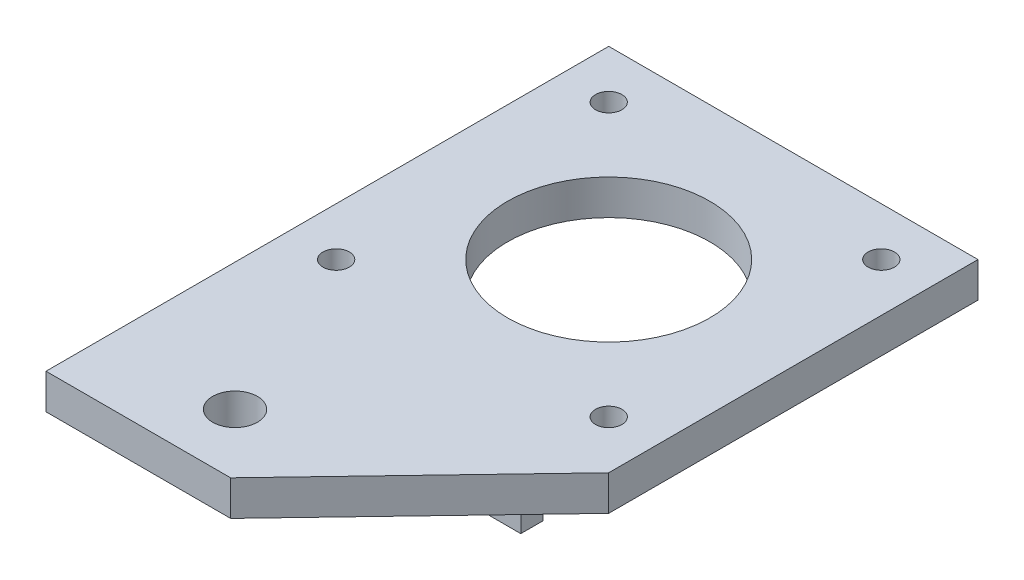
ISO-10303-21;
HEADER;
FILE_DESCRIPTION(('STEP AP214'),'2;1');
FILE_NAME('part.step','',(''),(''),'','','');
FILE_SCHEMA(('AUTOMOTIVE_DESIGN { 1 0 10303 214 1 1 1 1 }'));
ENDSEC;
DATA;
#1=APPLICATION_CONTEXT('core data for automotive mechanical design processes');
#2=APPLICATION_PROTOCOL_DEFINITION('international standard','automotive_design',2000,#1);
#3=PRODUCT_CONTEXT('',#1,'mechanical');
#4=PRODUCT('Part','Part','',(#3));
#5=PRODUCT_RELATED_PRODUCT_CATEGORY('part','',(#4));
#6=PRODUCT_DEFINITION_FORMATION('','',#4);
#7=PRODUCT_DEFINITION_CONTEXT('part definition',#1,'design');
#8=PRODUCT_DEFINITION('design','',#6,#7);
#9=PRODUCT_DEFINITION_SHAPE('','',#8);
#10=(LENGTH_UNIT() NAMED_UNIT(*) SI_UNIT(.MILLI.,.METRE.));
#11=(NAMED_UNIT(*) PLANE_ANGLE_UNIT() SI_UNIT($,.RADIAN.));
#12=(NAMED_UNIT(*) SI_UNIT($,.STERADIAN.) SOLID_ANGLE_UNIT());
#13=UNCERTAINTY_MEASURE_WITH_UNIT(LENGTH_MEASURE(1.E-05),#10,'distance_accuracy_value','');
#14=(GEOMETRIC_REPRESENTATION_CONTEXT(3) GLOBAL_UNCERTAINTY_ASSIGNED_CONTEXT((#13)) GLOBAL_UNIT_ASSIGNED_CONTEXT((#10,
#11,#12)) REPRESENTATION_CONTEXT('',''));
#15=CARTESIAN_POINT('',(0.,0.,0.));
#16=DIRECTION('',(0.,0.,1.));
#17=DIRECTION('',(1.,0.,0.));
#18=AXIS2_PLACEMENT_3D('',#15,#16,#17);
#19=CARTESIAN_POINT('',(0.,0.,0.));
#20=DIRECTION('',(0.,1.,0.));
#21=DIRECTION('',(0.,0.,1.));
#22=AXIS2_PLACEMENT_3D('',#19,#20,#21);
#23=PLANE('',#22);
#24=CARTESIAN_POINT('',(5.5,0.,-5.49999999999998));
#25=DIRECTION('',(0.,1.,0.));
#26=DIRECTION('',(0.,0.,1.));
#27=AXIS2_PLACEMENT_3D('',#24,#25,#26);
#28=CIRCLE('',#27,1.5);
#29=CARTESIAN_POINT('',(5.5,0.,-3.99999999999998));
#30=VERTEX_POINT('',#29);
#31=EDGE_CURVE('E142',#30,#30,#28,.F.);
#32=ORIENTED_EDGE('',*,*,#31,.F.);
#33=EDGE_LOOP('',(#32));
#34=FACE_BOUND('',#33,.T.);
#35=CARTESIAN_POINT('',(36.5,0.,-5.49999999999998));
#36=DIRECTION('',(0.,1.,0.));
#37=DIRECTION('',(0.,0.,1.));
#38=AXIS2_PLACEMENT_3D('',#35,#36,#37);
#39=CIRCLE('',#38,1.5);
#40=CARTESIAN_POINT('',(36.5,0.,-3.99999999999998));
#41=VERTEX_POINT('',#40);
#42=EDGE_CURVE('E190',#41,#41,#39,.T.);
#43=ORIENTED_EDGE('',*,*,#42,.T.);
#44=EDGE_LOOP('',(#43));
#45=FACE_BOUND('',#44,.T.);
#46=CARTESIAN_POINT('',(5.5,0.,-36.5));
#47=DIRECTION('',(0.,1.,0.));
#48=DIRECTION('',(0.,0.,1.));
#49=AXIS2_PLACEMENT_3D('',#46,#47,#48);
#50=CIRCLE('',#49,1.5);
#51=CARTESIAN_POINT('',(5.5,0.,-35.));
#52=VERTEX_POINT('',#51);
#53=EDGE_CURVE('E187',#52,#52,#50,.T.);
#54=ORIENTED_EDGE('',*,*,#53,.T.);
#55=EDGE_LOOP('',(#54));
#56=FACE_BOUND('',#55,.T.);
#57=CARTESIAN_POINT('',(21.,0.,-21.));
#58=DIRECTION('',(0.,1.,0.));
#59=DIRECTION('',(0.,0.,1.));
#60=AXIS2_PLACEMENT_3D('',#57,#58,#59);
#61=CIRCLE('',#60,11.5);
#62=CARTESIAN_POINT('',(21.,0.,-9.49999999999999));
#63=VERTEX_POINT('',#62);
#64=EDGE_CURVE('E184',#63,#63,#61,.T.);
#65=ORIENTED_EDGE('',*,*,#64,.T.);
#66=EDGE_LOOP('',(#65));
#67=FACE_BOUND('',#66,.T.);
#68=CARTESIAN_POINT('',(36.5,0.,-36.5));
#69=DIRECTION('',(0.,1.,0.));
#70=DIRECTION('',(0.,0.,1.));
#71=AXIS2_PLACEMENT_3D('',#68,#69,#70);
#72=CIRCLE('',#71,1.5);
#73=CARTESIAN_POINT('',(36.5,0.,-35.));
#74=VERTEX_POINT('',#73);
#75=EDGE_CURVE('E181',#74,#74,#72,.F.);
#76=ORIENTED_EDGE('',*,*,#75,.F.);
#77=EDGE_LOOP('',(#76));
#78=FACE_BOUND('',#77,.T.);
#79=CARTESIAN_POINT('',(14.5,0.,15.));
#80=DIRECTION('',(0.,1.,0.));
#81=DIRECTION('',(0.,0.,1.));
#82=AXIS2_PLACEMENT_3D('',#79,#80,#81);
#83=CIRCLE('',#82,2.55);
#84=CARTESIAN_POINT('',(14.5,0.,17.55));
#85=VERTEX_POINT('',#84);
#86=EDGE_CURVE('E129',#85,#85,#83,.T.);
#87=ORIENTED_EDGE('',*,*,#86,.T.);
#88=EDGE_LOOP('',(#87));
#89=FACE_BOUND('',#88,.T.);
#90=DIRECTION('',(-1.,0.,0.));
#91=VECTOR('',#90,1.);
#92=CARTESIAN_POINT('',(0.,0.,2.99999999999999));
#93=LINE('',#92,#91);
#94=CARTESIAN_POINT('',(35.,0.,2.99999999999999));
#95=VERTEX_POINT('',#94);
#96=CARTESIAN_POINT('',(0.,0.,2.99999999999999));
#97=VERTEX_POINT('',#96);
#98=EDGE_CURVE('E50',#95,#97,#93,.T.);
#99=ORIENTED_EDGE('',*,*,#98,.F.);
#100=DIRECTION('',(0.,0.,1.));
#101=VECTOR('',#100,1.);
#102=CARTESIAN_POINT('',(35.,0.,2.99999999999999));
#103=LINE('',#102,#101);
#104=CARTESIAN_POINT('',(35.,0.,0.499999999999995));
#105=VERTEX_POINT('',#104);
#106=EDGE_CURVE('E229',#105,#95,#103,.T.);
#107=ORIENTED_EDGE('',*,*,#106,.F.);
#108=DIRECTION('',(1.,0.,0.));
#109=VECTOR('',#108,1.);
#110=CARTESIAN_POINT('',(0.,0.,0.499999999999995));
#111=LINE('',#110,#109);
#112=CARTESIAN_POINT('',(0.,0.,0.499999999999995));
#113=VERTEX_POINT('',#112);
#114=EDGE_CURVE('E231',#113,#105,#111,.T.);
#115=ORIENTED_EDGE('',*,*,#114,.F.);
#116=DIRECTION('',(0.,0.,1.));
#117=VECTOR('',#116,1.);
#118=CARTESIAN_POINT('',(0.,0.,0.));
#119=LINE('',#118,#117);
#120=CARTESIAN_POINT('',(0.,0.,-42.));
#121=VERTEX_POINT('',#120);
#122=EDGE_CURVE('E128',#121,#113,#119,.T.);
#123=ORIENTED_EDGE('',*,*,#122,.F.);
#124=DIRECTION('',(1.,0.,0.));
#125=VECTOR('',#124,1.);
#126=CARTESIAN_POINT('',(0.,0.,-42.));
#127=LINE('',#126,#125);
#128=CARTESIAN_POINT('',(42.,0.,-42.));
#129=VERTEX_POINT('',#128);
#130=EDGE_CURVE('E177',#121,#129,#127,.T.);
#131=ORIENTED_EDGE('',*,*,#130,.T.);
#132=DIRECTION('',(0.,0.,-1.));
#133=VECTOR('',#132,1.);
#134=CARTESIAN_POINT('',(42.,0.,0.));
#135=LINE('',#134,#133);
#136=CARTESIAN_POINT('',(42.,0.,0.));
#137=VERTEX_POINT('',#136);
#138=EDGE_CURVE('E174',#137,#129,#135,.T.);
#139=ORIENTED_EDGE('',*,*,#138,.F.);
#140=DIRECTION('',(0.690475746682501,0.,-0.723355544143572));
#141=VECTOR('',#140,1.);
#142=CARTESIAN_POINT('',(21.9762162162162,0.,20.9772972972973));
#143=LINE('',#142,#141);
#144=CARTESIAN_POINT('',(21.,0.,22.));
#145=VERTEX_POINT('',#144);
#146=EDGE_CURVE('E172',#145,#137,#143,.T.);
#147=ORIENTED_EDGE('',*,*,#146,.F.);
#148=DIRECTION('',(1.,0.,0.));
#149=VECTOR('',#148,1.);
#150=CARTESIAN_POINT('',(0.,0.,22.));
#151=LINE('',#150,#149);
#152=CARTESIAN_POINT('',(0.,0.,22.));
#153=VERTEX_POINT('',#152);
#154=EDGE_CURVE('E132',#153,#145,#151,.T.);
#155=ORIENTED_EDGE('',*,*,#154,.F.);
#156=EDGE_CURVE('E55',#97,#153,#119,.T.);
#157=ORIENTED_EDGE('',*,*,#156,.F.);
#158=EDGE_LOOP('',(#99,#107,#115,#123,#131,#139,#147,#155,#157));
#159=FACE_BOUND('',#158,.T.);
#160=ADVANCED_FACE('F35',(#34,#45,#56,#67,#78,#89,#159),#23,.F.);
#161=CARTESIAN_POINT('',(0.,4.,22.));
#162=DIRECTION('',(0.,0.,-1.));
#163=DIRECTION('',(-1.,0.,0.));
#164=AXIS2_PLACEMENT_3D('',#161,#162,#163);
#165=PLANE('',#164);
#166=ORIENTED_EDGE('',*,*,#154,.T.);
#167=DIRECTION('',(0.,-1.,0.));
#168=VECTOR('',#167,1.);
#169=CARTESIAN_POINT('',(21.,4.,22.));
#170=LINE('',#169,#168);
#171=CARTESIAN_POINT('',(21.,4.,22.));
#172=VERTEX_POINT('',#171);
#173=EDGE_CURVE('E11',#172,#145,#170,.T.);
#174=ORIENTED_EDGE('',*,*,#173,.F.);
#175=DIRECTION('',(1.,0.,0.));
#176=VECTOR('',#175,1.);
#177=CARTESIAN_POINT('',(0.,4.,22.));
#178=LINE('',#177,#176);
#179=CARTESIAN_POINT('',(0.,4.,22.));
#180=VERTEX_POINT('',#179);
#181=EDGE_CURVE('E141',#180,#172,#178,.T.);
#182=ORIENTED_EDGE('',*,*,#181,.F.);
#183=DIRECTION('',(0.,-1.,0.));
#184=VECTOR('',#183,1.);
#185=CARTESIAN_POINT('',(0.,4.,22.));
#186=LINE('',#185,#184);
#187=EDGE_CURVE('E168',#180,#153,#186,.T.);
#188=ORIENTED_EDGE('',*,*,#187,.T.);
#189=EDGE_LOOP('',(#166,#174,#182,#188));
#190=FACE_BOUND('',#189,.T.);
#191=ADVANCED_FACE('F221',(#190),#165,.F.);
#192=CARTESIAN_POINT('',(21.9762162162162,4.,20.9772972972973));
#193=DIRECTION('',(-0.723355544143572,0.,-0.690475746682501));
#194=DIRECTION('',(-0.690475746682501,0.,0.723355544143572));
#195=AXIS2_PLACEMENT_3D('',#192,#193,#194);
#196=PLANE('',#195);
#197=ORIENTED_EDGE('',*,*,#146,.T.);
#198=DIRECTION('',(0.,-1.,0.));
#199=VECTOR('',#198,1.);
#200=CARTESIAN_POINT('',(42.,4.,0.));
#201=LINE('',#200,#199);
#202=CARTESIAN_POINT('',(42.,4.,0.));
#203=VERTEX_POINT('',#202);
#204=EDGE_CURVE('E43',#203,#137,#201,.T.);
#205=ORIENTED_EDGE('',*,*,#204,.F.);
#206=DIRECTION('',(0.690475746682501,0.,-0.723355544143572));
#207=VECTOR('',#206,1.);
#208=CARTESIAN_POINT('',(21.9762162162162,4.,20.9772972972973));
#209=LINE('',#208,#207);
#210=EDGE_CURVE('E145',#172,#203,#209,.T.);
#211=ORIENTED_EDGE('',*,*,#210,.F.);
#212=ORIENTED_EDGE('',*,*,#173,.T.);
#213=EDGE_LOOP('',(#197,#205,#211,#212));
#214=FACE_BOUND('',#213,.T.);
#215=ADVANCED_FACE('F219',(#214),#196,.F.);
#216=CARTESIAN_POINT('',(42.,4.,0.));
#217=DIRECTION('',(-1.,0.,0.));
#218=DIRECTION('',(0.,0.,1.));
#219=AXIS2_PLACEMENT_3D('',#216,#217,#218);
#220=PLANE('',#219);
#221=ORIENTED_EDGE('',*,*,#138,.T.);
#222=DIRECTION('',(0.,-1.,0.));
#223=VECTOR('',#222,1.);
#224=CARTESIAN_POINT('',(42.,4.,-42.));
#225=LINE('',#224,#223);
#226=CARTESIAN_POINT('',(42.,4.,-42.));
#227=VERTEX_POINT('',#226);
#228=EDGE_CURVE('E199',#227,#129,#225,.T.);
#229=ORIENTED_EDGE('',*,*,#228,.F.);
#230=DIRECTION('',(0.,0.,-1.));
#231=VECTOR('',#230,1.);
#232=CARTESIAN_POINT('',(42.,4.,0.));
#233=LINE('',#232,#231);
#234=EDGE_CURVE('E147',#203,#227,#233,.T.);
#235=ORIENTED_EDGE('',*,*,#234,.F.);
#236=ORIENTED_EDGE('',*,*,#204,.T.);
#237=EDGE_LOOP('',(#221,#229,#235,#236));
#238=FACE_BOUND('',#237,.T.);
#239=ADVANCED_FACE('F205',(#238),#220,.F.);
#240=CARTESIAN_POINT('',(0.,4.,-42.));
#241=DIRECTION('',(0.,0.,-1.));
#242=DIRECTION('',(-1.,0.,0.));
#243=AXIS2_PLACEMENT_3D('',#240,#241,#242);
#244=PLANE('',#243);
#245=ORIENTED_EDGE('',*,*,#130,.F.);
#246=DIRECTION('',(0.,-1.,0.));
#247=VECTOR('',#246,1.);
#248=CARTESIAN_POINT('',(0.,4.,-42.));
#249=LINE('',#248,#247);
#250=CARTESIAN_POINT('',(0.,4.,-42.));
#251=VERTEX_POINT('',#250);
#252=EDGE_CURVE('E197',#251,#121,#249,.T.);
#253=ORIENTED_EDGE('',*,*,#252,.F.);
#254=DIRECTION('',(1.,0.,0.));
#255=VECTOR('',#254,1.);
#256=CARTESIAN_POINT('',(0.,4.,-42.));
#257=LINE('',#256,#255);
#258=EDGE_CURVE('E149',#251,#227,#257,.T.);
#259=ORIENTED_EDGE('',*,*,#258,.T.);
#260=ORIENTED_EDGE('',*,*,#228,.T.);
#261=EDGE_LOOP('',(#245,#253,#259,#260));
#262=FACE_BOUND('',#261,.T.);
#263=ADVANCED_FACE('F210',(#262),#244,.T.);
#264=CARTESIAN_POINT('',(36.5,4.,-5.49999999999998));
#265=DIRECTION('',(0.,-1.,0.));
#266=DIRECTION('',(0.,0.,-1.));
#267=AXIS2_PLACEMENT_3D('',#264,#265,#266);
#268=CYLINDRICAL_SURFACE('',#267,1.5);
#269=CARTESIAN_POINT('',(36.5,4.,-5.49999999999998));
#270=DIRECTION('',(0.,1.,0.));
#271=DIRECTION('',(0.,0.,1.));
#272=AXIS2_PLACEMENT_3D('',#269,#270,#271);
#273=CIRCLE('',#272,1.5);
#274=CARTESIAN_POINT('',(36.5,4.,-3.99999999999998));
#275=VERTEX_POINT('',#274);
#276=EDGE_CURVE('E163',#275,#275,#273,.T.);
#277=ORIENTED_EDGE('',*,*,#276,.T.);
#278=EDGE_LOOP('',(#277));
#279=FACE_BOUND('',#278,.T.);
#280=ORIENTED_EDGE('',*,*,#42,.F.);
#281=EDGE_LOOP('',(#280));
#282=FACE_BOUND('',#281,.T.);
#283=ADVANCED_FACE('F260',(#279,#282),#268,.F.);
#284=CARTESIAN_POINT('',(5.5,4.,-36.5));
#285=DIRECTION('',(0.,-1.,0.));
#286=DIRECTION('',(0.,0.,-1.));
#287=AXIS2_PLACEMENT_3D('',#284,#285,#286);
#288=CYLINDRICAL_SURFACE('',#287,1.5);
#289=CARTESIAN_POINT('',(5.5,4.,-36.5));
#290=DIRECTION('',(0.,1.,0.));
#291=DIRECTION('',(0.,0.,1.));
#292=AXIS2_PLACEMENT_3D('',#289,#290,#291);
#293=CIRCLE('',#292,1.5);
#294=CARTESIAN_POINT('',(5.5,4.,-35.));
#295=VERTEX_POINT('',#294);
#296=EDGE_CURVE('E160',#295,#295,#293,.T.);
#297=ORIENTED_EDGE('',*,*,#296,.T.);
#298=EDGE_LOOP('',(#297));
#299=FACE_BOUND('',#298,.T.);
#300=ORIENTED_EDGE('',*,*,#53,.F.);
#301=EDGE_LOOP('',(#300));
#302=FACE_BOUND('',#301,.T.);
#303=ADVANCED_FACE('F263',(#299,#302),#288,.F.);
#304=CARTESIAN_POINT('',(21.,4.,-21.));
#305=DIRECTION('',(0.,-1.,0.));
#306=DIRECTION('',(0.,0.,-1.));
#307=AXIS2_PLACEMENT_3D('',#304,#305,#306);
#308=CYLINDRICAL_SURFACE('',#307,11.5);
#309=CARTESIAN_POINT('',(21.,4.,-21.));
#310=DIRECTION('',(0.,1.,0.));
#311=DIRECTION('',(0.,0.,1.));
#312=AXIS2_PLACEMENT_3D('',#309,#310,#311);
#313=CIRCLE('',#312,11.5);
#314=CARTESIAN_POINT('',(21.,4.,-9.49999999999999));
#315=VERTEX_POINT('',#314);
#316=EDGE_CURVE('E157',#315,#315,#313,.T.);
#317=ORIENTED_EDGE('',*,*,#316,.T.);
#318=EDGE_LOOP('',(#317));
#319=FACE_BOUND('',#318,.T.);
#320=ORIENTED_EDGE('',*,*,#64,.F.);
#321=EDGE_LOOP('',(#320));
#322=FACE_BOUND('',#321,.T.);
#323=ADVANCED_FACE('F267',(#319,#322),#308,.F.);
#324=CARTESIAN_POINT('',(36.5,4.,-36.5));
#325=DIRECTION('',(0.,-1.,0.));
#326=DIRECTION('',(0.,0.,-1.));
#327=AXIS2_PLACEMENT_3D('',#324,#325,#326);
#328=CYLINDRICAL_SURFACE('',#327,1.5);
#329=CARTESIAN_POINT('',(36.5,4.,-36.5));
#330=DIRECTION('',(0.,1.,0.));
#331=DIRECTION('',(0.,0.,1.));
#332=AXIS2_PLACEMENT_3D('',#329,#330,#331);
#333=CIRCLE('',#332,1.5);
#334=CARTESIAN_POINT('',(36.5,4.,-35.));
#335=VERTEX_POINT('',#334);
#336=EDGE_CURVE('E154',#335,#335,#333,.F.);
#337=ORIENTED_EDGE('',*,*,#336,.F.);
#338=EDGE_LOOP('',(#337));
#339=FACE_BOUND('',#338,.T.);
#340=ORIENTED_EDGE('',*,*,#75,.T.);
#341=EDGE_LOOP('',(#340));
#342=FACE_BOUND('',#341,.T.);
#343=ADVANCED_FACE('F271',(#339,#342),#328,.F.);
#344=CARTESIAN_POINT('',(0.,4.,0.));
#345=DIRECTION('',(1.,0.,0.));
#346=DIRECTION('',(0.,0.,-1.));
#347=AXIS2_PLACEMENT_3D('',#344,#345,#346);
#348=PLANE('',#347);
#349=ORIENTED_EDGE('',*,*,#122,.T.);
#350=DIRECTION('',(0.,1.,0.));
#351=VECTOR('',#350,1.);
#352=CARTESIAN_POINT('',(0.,-4.,0.499999999999995));
#353=LINE('',#352,#351);
#354=CARTESIAN_POINT('',(0.,-4.,0.499999999999995));
#355=VERTEX_POINT('',#354);
#356=EDGE_CURVE('E109',#355,#113,#353,.T.);
#357=ORIENTED_EDGE('',*,*,#356,.F.);
#358=DIRECTION('',(0.,0.,-1.));
#359=VECTOR('',#358,1.);
#360=CARTESIAN_POINT('',(0.,-4.,2.99999999999999));
#361=LINE('',#360,#359);
#362=CARTESIAN_POINT('',(0.,-4.,2.99999999999999));
#363=VERTEX_POINT('',#362);
#364=EDGE_CURVE('E115',#363,#355,#361,.T.);
#365=ORIENTED_EDGE('',*,*,#364,.F.);
#366=DIRECTION('',(0.,1.,0.));
#367=VECTOR('',#366,1.);
#368=CARTESIAN_POINT('',(0.,-4.,2.99999999999999));
#369=LINE('',#368,#367);
#370=EDGE_CURVE('E222',#363,#97,#369,.T.);
#371=ORIENTED_EDGE('',*,*,#370,.T.);
#372=ORIENTED_EDGE('',*,*,#156,.T.);
#373=ORIENTED_EDGE('',*,*,#187,.F.);
#374=DIRECTION('',(0.,0.,1.));
#375=VECTOR('',#374,1.);
#376=CARTESIAN_POINT('',(0.,4.,0.));
#377=LINE('',#376,#375);
#378=EDGE_CURVE('E152',#251,#180,#377,.T.);
#379=ORIENTED_EDGE('',*,*,#378,.F.);
#380=ORIENTED_EDGE('',*,*,#252,.T.);
#381=EDGE_LOOP('',(#349,#357,#365,#371,#372,#373,#379,#380));
#382=FACE_BOUND('',#381,.T.);
#383=ADVANCED_FACE('F126',(#382),#348,.F.);
#384=CARTESIAN_POINT('',(14.5,4.,15.));
#385=DIRECTION('',(0.,-1.,0.));
#386=DIRECTION('',(0.,0.,-1.));
#387=AXIS2_PLACEMENT_3D('',#384,#385,#386);
#388=CYLINDRICAL_SURFACE('',#387,2.55);
#389=CARTESIAN_POINT('',(14.5,4.,15.));
#390=DIRECTION('',(0.,1.,0.));
#391=DIRECTION('',(0.,0.,1.));
#392=AXIS2_PLACEMENT_3D('',#389,#390,#391);
#393=CIRCLE('',#392,2.55);
#394=CARTESIAN_POINT('',(14.5,4.,17.55));
#395=VERTEX_POINT('',#394);
#396=EDGE_CURVE('E138',#395,#395,#393,.T.);
#397=ORIENTED_EDGE('',*,*,#396,.T.);
#398=EDGE_LOOP('',(#397));
#399=FACE_BOUND('',#398,.T.);
#400=ORIENTED_EDGE('',*,*,#86,.F.);
#401=EDGE_LOOP('',(#400));
#402=FACE_BOUND('',#401,.T.);
#403=ADVANCED_FACE('F37',(#399,#402),#388,.F.);
#404=CARTESIAN_POINT('',(5.5,4.,-5.49999999999998));
#405=DIRECTION('',(0.,-1.,0.));
#406=DIRECTION('',(0.,0.,-1.));
#407=AXIS2_PLACEMENT_3D('',#404,#405,#406);
#408=CYLINDRICAL_SURFACE('',#407,1.5);
#409=CARTESIAN_POINT('',(5.5,4.,-5.49999999999998));
#410=DIRECTION('',(0.,1.,0.));
#411=DIRECTION('',(0.,0.,1.));
#412=AXIS2_PLACEMENT_3D('',#409,#410,#411);
#413=CIRCLE('',#412,1.5);
#414=CARTESIAN_POINT('',(5.5,4.,-3.99999999999998));
#415=VERTEX_POINT('',#414);
#416=EDGE_CURVE('E166',#415,#415,#413,.F.);
#417=ORIENTED_EDGE('',*,*,#416,.F.);
#418=EDGE_LOOP('',(#417));
#419=FACE_BOUND('',#418,.T.);
#420=ORIENTED_EDGE('',*,*,#31,.T.);
#421=EDGE_LOOP('',(#420));
#422=FACE_BOUND('',#421,.T.);
#423=ADVANCED_FACE('F256',(#419,#422),#408,.F.);
#424=CARTESIAN_POINT('',(0.,4.,0.));
#425=DIRECTION('',(0.,1.,0.));
#426=DIRECTION('',(0.,0.,1.));
#427=AXIS2_PLACEMENT_3D('',#424,#425,#426);
#428=PLANE('',#427);
#429=ORIENTED_EDGE('',*,*,#396,.F.);
#430=EDGE_LOOP('',(#429));
#431=FACE_BOUND('',#430,.T.);
#432=ORIENTED_EDGE('',*,*,#181,.T.);
#433=ORIENTED_EDGE('',*,*,#210,.T.);
#434=ORIENTED_EDGE('',*,*,#234,.T.);
#435=ORIENTED_EDGE('',*,*,#258,.F.);
#436=ORIENTED_EDGE('',*,*,#378,.T.);
#437=EDGE_LOOP('',(#432,#433,#434,#435,#436));
#438=FACE_BOUND('',#437,.T.);
#439=ORIENTED_EDGE('',*,*,#336,.T.);
#440=EDGE_LOOP('',(#439));
#441=FACE_BOUND('',#440,.T.);
#442=ORIENTED_EDGE('',*,*,#316,.F.);
#443=EDGE_LOOP('',(#442));
#444=FACE_BOUND('',#443,.T.);
#445=ORIENTED_EDGE('',*,*,#296,.F.);
#446=EDGE_LOOP('',(#445));
#447=FACE_BOUND('',#446,.T.);
#448=ORIENTED_EDGE('',*,*,#276,.F.);
#449=EDGE_LOOP('',(#448));
#450=FACE_BOUND('',#449,.T.);
#451=ORIENTED_EDGE('',*,*,#416,.T.);
#452=EDGE_LOOP('',(#451));
#453=FACE_BOUND('',#452,.T.);
#454=ADVANCED_FACE('F214',(#431,#438,#441,#444,#447,#450,#453),#428,.T.);
#455=CARTESIAN_POINT('',(0.,-4.,0.499999999999995));
#456=DIRECTION('',(0.,0.,1.));
#457=DIRECTION('',(1.,0.,0.));
#458=AXIS2_PLACEMENT_3D('',#455,#456,#457);
#459=PLANE('',#458);
#460=ORIENTED_EDGE('',*,*,#114,.T.);
#461=DIRECTION('',(0.,1.,0.));
#462=VECTOR('',#461,1.);
#463=CARTESIAN_POINT('',(35.,-4.,0.499999999999995));
#464=LINE('',#463,#462);
#465=CARTESIAN_POINT('',(35.,-4.,0.499999999999995));
#466=VERTEX_POINT('',#465);
#467=EDGE_CURVE('E111',#466,#105,#464,.T.);
#468=ORIENTED_EDGE('',*,*,#467,.F.);
#469=DIRECTION('',(1.,0.,0.));
#470=VECTOR('',#469,1.);
#471=CARTESIAN_POINT('',(0.,-4.,0.499999999999995));
#472=LINE('',#471,#470);
#473=EDGE_CURVE('E104',#355,#466,#472,.T.);
#474=ORIENTED_EDGE('',*,*,#473,.F.);
#475=ORIENTED_EDGE('',*,*,#356,.T.);
#476=EDGE_LOOP('',(#460,#468,#474,#475));
#477=FACE_BOUND('',#476,.T.);
#478=ADVANCED_FACE('F107',(#477),#459,.F.);
#479=CARTESIAN_POINT('',(35.,-4.,2.99999999999999));
#480=DIRECTION('',(-1.,0.,0.));
#481=DIRECTION('',(0.,0.,1.));
#482=AXIS2_PLACEMENT_3D('',#479,#480,#481);
#483=PLANE('',#482);
#484=ORIENTED_EDGE('',*,*,#106,.T.);
#485=DIRECTION('',(0.,1.,0.));
#486=VECTOR('',#485,1.);
#487=CARTESIAN_POINT('',(35.,-4.,2.99999999999999));
#488=LINE('',#487,#486);
#489=CARTESIAN_POINT('',(35.,-4.,2.99999999999999));
#490=VERTEX_POINT('',#489);
#491=EDGE_CURVE('E134',#490,#95,#488,.T.);
#492=ORIENTED_EDGE('',*,*,#491,.F.);
#493=DIRECTION('',(0.,0.,1.));
#494=VECTOR('',#493,1.);
#495=CARTESIAN_POINT('',(35.,-4.,2.99999999999999));
#496=LINE('',#495,#494);
#497=EDGE_CURVE('E114',#466,#490,#496,.T.);
#498=ORIENTED_EDGE('',*,*,#497,.F.);
#499=ORIENTED_EDGE('',*,*,#467,.T.);
#500=EDGE_LOOP('',(#484,#492,#498,#499));
#501=FACE_BOUND('',#500,.T.);
#502=ADVANCED_FACE('F235',(#501),#483,.F.);
#503=CARTESIAN_POINT('',(0.,-4.,2.99999999999999));
#504=DIRECTION('',(0.,0.,-1.));
#505=DIRECTION('',(-1.,0.,0.));
#506=AXIS2_PLACEMENT_3D('',#503,#504,#505);
#507=PLANE('',#506);
#508=ORIENTED_EDGE('',*,*,#98,.T.);
#509=ORIENTED_EDGE('',*,*,#370,.F.);
#510=DIRECTION('',(-1.,0.,0.));
#511=VECTOR('',#510,1.);
#512=CARTESIAN_POINT('',(0.,-4.,2.99999999999999));
#513=LINE('',#512,#511);
#514=EDGE_CURVE('E120',#490,#363,#513,.T.);
#515=ORIENTED_EDGE('',*,*,#514,.F.);
#516=ORIENTED_EDGE('',*,*,#491,.T.);
#517=EDGE_LOOP('',(#508,#509,#515,#516));
#518=FACE_BOUND('',#517,.T.);
#519=ADVANCED_FACE('F236',(#518),#507,.F.);
#520=CARTESIAN_POINT('',(0.,-4.,0.));
#521=DIRECTION('',(0.,-1.,0.));
#522=DIRECTION('',(0.,0.,-1.));
#523=AXIS2_PLACEMENT_3D('',#520,#521,#522);
#524=PLANE('',#523);
#525=ORIENTED_EDGE('',*,*,#364,.T.);
#526=ORIENTED_EDGE('',*,*,#473,.T.);
#527=ORIENTED_EDGE('',*,*,#497,.T.);
#528=ORIENTED_EDGE('',*,*,#514,.T.);
#529=EDGE_LOOP('',(#525,#526,#527,#528));
#530=FACE_BOUND('',#529,.T.);
#531=ADVANCED_FACE('F118',(#530),#524,.T.);
#532=CLOSED_SHELL('',(#160,#191,#215,#239,#263,#283,#303,#323,#343,#383,#403,#423,#454,#478,
#502,#519,#531));
#533=MANIFOLD_SOLID_BREP('B2',#532);
#534=ADVANCED_BREP_SHAPE_REPRESENTATION('',(#18,#533),#14);
#535=SHAPE_DEFINITION_REPRESENTATION(#9,#534);
ENDSEC;
END-ISO-10303-21;
